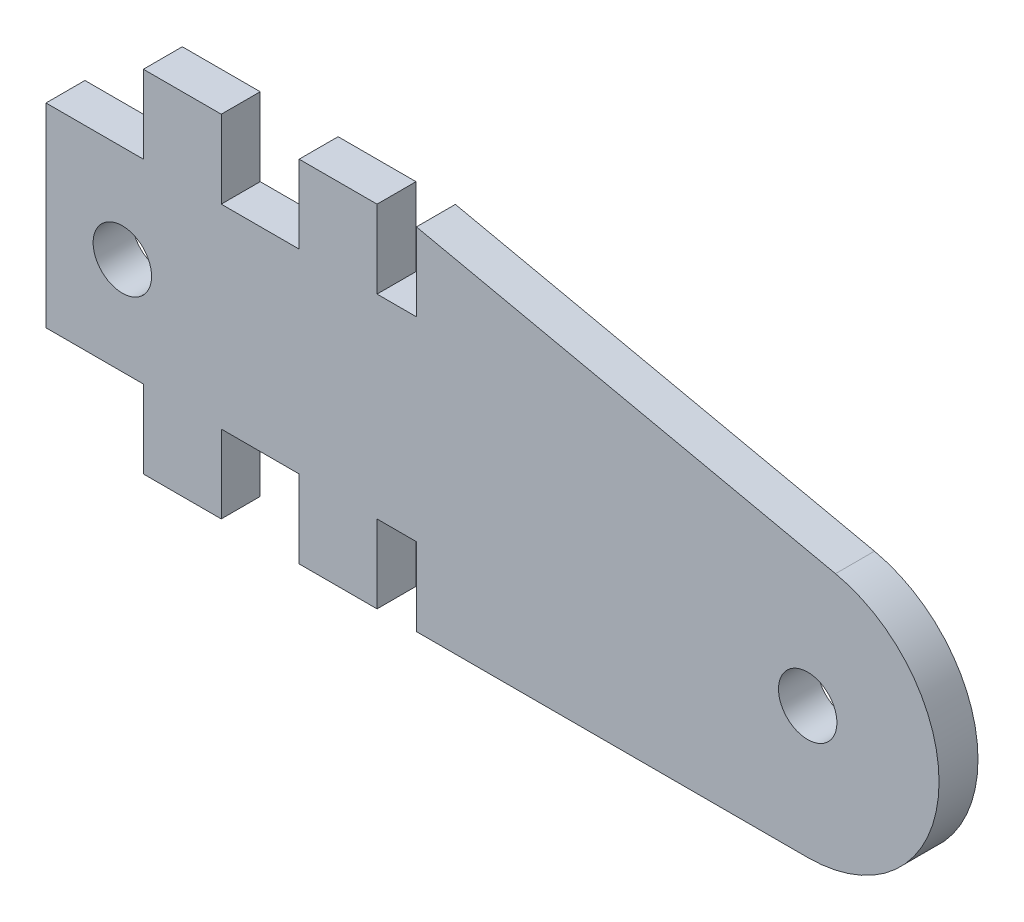
ISO-10303-21;
HEADER;
FILE_DESCRIPTION(('STEP AP214'),'2;1');
FILE_NAME('part.step','',(''),(''),'','','');
FILE_SCHEMA(('AUTOMOTIVE_DESIGN { 1 0 10303 214 1 1 1 1 }'));
ENDSEC;
DATA;
#1=APPLICATION_CONTEXT('core data for automotive mechanical design processes');
#2=APPLICATION_PROTOCOL_DEFINITION('international standard','automotive_design',2000,#1);
#3=PRODUCT_CONTEXT('',#1,'mechanical');
#4=PRODUCT('Part','Part','',(#3));
#5=PRODUCT_RELATED_PRODUCT_CATEGORY('part','',(#4));
#6=PRODUCT_DEFINITION_FORMATION('','',#4);
#7=PRODUCT_DEFINITION_CONTEXT('part definition',#1,'design');
#8=PRODUCT_DEFINITION('design','',#6,#7);
#9=PRODUCT_DEFINITION_SHAPE('','',#8);
#10=(LENGTH_UNIT() NAMED_UNIT(*) SI_UNIT(.MILLI.,.METRE.));
#11=(NAMED_UNIT(*) PLANE_ANGLE_UNIT() SI_UNIT($,.RADIAN.));
#12=(NAMED_UNIT(*) SI_UNIT($,.STERADIAN.) SOLID_ANGLE_UNIT());
#13=UNCERTAINTY_MEASURE_WITH_UNIT(LENGTH_MEASURE(1.E-05),#10,'distance_accuracy_value','');
#14=(GEOMETRIC_REPRESENTATION_CONTEXT(3) GLOBAL_UNCERTAINTY_ASSIGNED_CONTEXT((#13)) GLOBAL_UNIT_ASSIGNED_CONTEXT((#10,
#11,#12)) REPRESENTATION_CONTEXT('',''));
#15=CARTESIAN_POINT('',(0.,0.,0.));
#16=DIRECTION('',(0.,0.,1.));
#17=DIRECTION('',(1.,0.,0.));
#18=AXIS2_PLACEMENT_3D('',#15,#16,#17);
#19=CARTESIAN_POINT('',(39.11449585108,6.74534308282998,2.));
#20=DIRECTION('',(0.,0.,1.));
#21=DIRECTION('',(1.,0.,0.));
#22=AXIS2_PLACEMENT_3D('',#19,#20,#21);
#23=PLANE('',#22);
#24=CARTESIAN_POINT('',(3.92049009293526,8.99999999999998,2.));
#25=DIRECTION('',(0.,0.,1.));
#26=DIRECTION('',(1.,0.,0.));
#27=AXIS2_PLACEMENT_3D('',#24,#25,#26);
#28=CIRCLE('',#27,1.5);
#29=CARTESIAN_POINT('',(5.42049009293527,8.99999999999998,2.));
#30=VERTEX_POINT('',#29);
#31=EDGE_CURVE('E230',#30,#30,#28,.T.);
#32=ORIENTED_EDGE('',*,*,#31,.F.);
#33=EDGE_LOOP('',(#32));
#34=FACE_BOUND('',#33,.T.);
#35=DIRECTION('',(0.,1.,0.));
#36=VECTOR('',#35,1.);
#37=CARTESIAN_POINT('',(9.,0.,2.));
#38=LINE('',#37,#36);
#39=CARTESIAN_POINT('',(9.,0.,2.));
#40=VERTEX_POINT('',#39);
#41=CARTESIAN_POINT('',(9.,4.,2.));
#42=VERTEX_POINT('',#41);
#43=EDGE_CURVE('E273',#40,#42,#38,.T.);
#44=ORIENTED_EDGE('',*,*,#43,.T.);
#45=DIRECTION('',(1.,0.,0.));
#46=VECTOR('',#45,1.);
#47=CARTESIAN_POINT('',(9.,4.,2.));
#48=LINE('',#47,#46);
#49=CARTESIAN_POINT('',(13.,4.,2.));
#50=VERTEX_POINT('',#49);
#51=EDGE_CURVE('E141',#42,#50,#48,.T.);
#52=ORIENTED_EDGE('',*,*,#51,.T.);
#53=DIRECTION('',(0.,-1.,0.));
#54=VECTOR('',#53,1.);
#55=CARTESIAN_POINT('',(13.,4.,2.));
#56=LINE('',#55,#54);
#57=CARTESIAN_POINT('',(13.,0.,2.));
#58=VERTEX_POINT('',#57);
#59=EDGE_CURVE('E336',#50,#58,#56,.T.);
#60=ORIENTED_EDGE('',*,*,#59,.T.);
#61=DIRECTION('',(1.,0.,0.));
#62=VECTOR('',#61,1.);
#63=CARTESIAN_POINT('',(13.,0.,2.));
#64=LINE('',#63,#62);
#65=CARTESIAN_POINT('',(17.,0.,2.));
#66=VERTEX_POINT('',#65);
#67=EDGE_CURVE('E355',#58,#66,#64,.T.);
#68=ORIENTED_EDGE('',*,*,#67,.T.);
#69=DIRECTION('',(0.,1.,0.));
#70=VECTOR('',#69,1.);
#71=CARTESIAN_POINT('',(17.,0.,2.));
#72=LINE('',#71,#70);
#73=CARTESIAN_POINT('',(17.,4.,2.));
#74=VERTEX_POINT('',#73);
#75=EDGE_CURVE('E352',#66,#74,#72,.T.);
#76=ORIENTED_EDGE('',*,*,#75,.T.);
#77=DIRECTION('',(1.,0.,0.));
#78=VECTOR('',#77,1.);
#79=CARTESIAN_POINT('',(17.,4.,2.));
#80=LINE('',#79,#78);
#81=CARTESIAN_POINT('',(19.0215619335038,4.,2.));
#82=VERTEX_POINT('',#81);
#83=EDGE_CURVE('E354',#74,#82,#80,.T.);
#84=ORIENTED_EDGE('',*,*,#83,.T.);
#85=DIRECTION('',(0.,-1.,0.));
#86=VECTOR('',#85,1.);
#87=CARTESIAN_POINT('',(19.0215619335038,4.,2.));
#88=LINE('',#87,#86);
#89=CARTESIAN_POINT('',(19.0215619335038,0.,2.));
#90=VERTEX_POINT('',#89);
#91=EDGE_CURVE('E357',#82,#90,#88,.T.);
#92=ORIENTED_EDGE('',*,*,#91,.T.);
#93=DIRECTION('',(1.,0.,0.));
#94=VECTOR('',#93,1.);
#95=CARTESIAN_POINT('',(19.0215619335038,0.,2.));
#96=LINE('',#95,#94);
#97=CARTESIAN_POINT('',(39.11449585108,0.,2.));
#98=VERTEX_POINT('',#97);
#99=EDGE_CURVE('E363',#90,#98,#96,.T.);
#100=ORIENTED_EDGE('',*,*,#99,.T.);
#101=CARTESIAN_POINT('',(39.11449585108,6.74534308282998,2.));
#102=DIRECTION('',(0.,0.,1.));
#103=DIRECTION('',(1.,0.,0.));
#104=AXIS2_PLACEMENT_3D('',#101,#102,#103);
#105=CIRCLE('',#104,6.74534308282998);
#106=CARTESIAN_POINT('',(40.5426460894979,13.3377660214459,2.));
#107=VERTEX_POINT('',#106);
#108=EDGE_CURVE('E365',#98,#107,#105,.T.);
#109=ORIENTED_EDGE('',*,*,#108,.T.);
#110=DIRECTION('',(-0.977329523148594,0.211723884297783,0.));
#111=VECTOR('',#110,1.);
#112=CARTESIAN_POINT('',(19.0215619335039,17.9999883567818,2.));
#113=LINE('',#112,#111);
#114=CARTESIAN_POINT('',(19.0215619335039,17.9999883567818,2.));
#115=VERTEX_POINT('',#114);
#116=EDGE_CURVE('E367',#107,#115,#113,.T.);
#117=ORIENTED_EDGE('',*,*,#116,.T.);
#118=DIRECTION('',(0.,-1.,0.));
#119=VECTOR('',#118,1.);
#120=CARTESIAN_POINT('',(19.0215619335038,13.9999883567817,2.));
#121=LINE('',#120,#119);
#122=CARTESIAN_POINT('',(19.0215619335038,13.9999883567817,2.));
#123=VERTEX_POINT('',#122);
#124=EDGE_CURVE('E369',#115,#123,#121,.T.);
#125=ORIENTED_EDGE('',*,*,#124,.T.);
#126=DIRECTION('',(-1.,0.,0.));
#127=VECTOR('',#126,1.);
#128=CARTESIAN_POINT('',(17.,13.9999883567817,2.));
#129=LINE('',#128,#127);
#130=CARTESIAN_POINT('',(17.,13.9999883567817,2.));
#131=VERTEX_POINT('',#130);
#132=EDGE_CURVE('E371',#123,#131,#129,.T.);
#133=ORIENTED_EDGE('',*,*,#132,.T.);
#134=DIRECTION('',(0.,1.,0.));
#135=VECTOR('',#134,1.);
#136=CARTESIAN_POINT('',(17.,17.9999883567817,2.));
#137=LINE('',#136,#135);
#138=CARTESIAN_POINT('',(17.,17.9999883567817,2.));
#139=VERTEX_POINT('',#138);
#140=EDGE_CURVE('E373',#131,#139,#137,.T.);
#141=ORIENTED_EDGE('',*,*,#140,.T.);
#142=DIRECTION('',(-1.,0.,0.));
#143=VECTOR('',#142,1.);
#144=CARTESIAN_POINT('',(13.,17.9999883567817,2.));
#145=LINE('',#144,#143);
#146=CARTESIAN_POINT('',(13.,17.9999883567817,2.));
#147=VERTEX_POINT('',#146);
#148=EDGE_CURVE('E375',#139,#147,#145,.T.);
#149=ORIENTED_EDGE('',*,*,#148,.T.);
#150=DIRECTION('',(0.,-1.,0.));
#151=VECTOR('',#150,1.);
#152=CARTESIAN_POINT('',(13.,13.9999883567817,2.));
#153=LINE('',#152,#151);
#154=CARTESIAN_POINT('',(13.,13.9999883567817,2.));
#155=VERTEX_POINT('',#154);
#156=EDGE_CURVE('E377',#147,#155,#153,.T.);
#157=ORIENTED_EDGE('',*,*,#156,.T.);
#158=DIRECTION('',(-1.,0.,0.));
#159=VECTOR('',#158,1.);
#160=CARTESIAN_POINT('',(9.,13.9999883567817,2.));
#161=LINE('',#160,#159);
#162=CARTESIAN_POINT('',(9.,13.9999883567817,2.));
#163=VERTEX_POINT('',#162);
#164=EDGE_CURVE('E379',#155,#163,#161,.T.);
#165=ORIENTED_EDGE('',*,*,#164,.T.);
#166=DIRECTION('',(0.,1.,0.));
#167=VECTOR('',#166,1.);
#168=CARTESIAN_POINT('',(9.,17.9999883567817,2.));
#169=LINE('',#168,#167);
#170=CARTESIAN_POINT('',(9.,17.9999883567817,2.));
#171=VERTEX_POINT('',#170);
#172=EDGE_CURVE('E381',#163,#171,#169,.T.);
#173=ORIENTED_EDGE('',*,*,#172,.T.);
#174=DIRECTION('',(-1.,0.,0.));
#175=VECTOR('',#174,1.);
#176=CARTESIAN_POINT('',(5.,17.9999883567817,2.));
#177=LINE('',#176,#175);
#178=CARTESIAN_POINT('',(5.,17.9999883567817,2.));
#179=VERTEX_POINT('',#178);
#180=EDGE_CURVE('E383',#171,#179,#177,.T.);
#181=ORIENTED_EDGE('',*,*,#180,.T.);
#182=DIRECTION('',(0.,-1.,0.));
#183=VECTOR('',#182,1.);
#184=CARTESIAN_POINT('',(5.,13.9999883567817,2.));
#185=LINE('',#184,#183);
#186=CARTESIAN_POINT('',(5.,13.9999883567817,2.));
#187=VERTEX_POINT('',#186);
#188=EDGE_CURVE('E385',#179,#187,#185,.T.);
#189=ORIENTED_EDGE('',*,*,#188,.T.);
#190=DIRECTION('',(-1.,0.,0.));
#191=VECTOR('',#190,1.);
#192=CARTESIAN_POINT('',(5.,13.9999883567817,2.));
#193=LINE('',#192,#191);
#194=CARTESIAN_POINT('',(0.,13.9999883567817,2.));
#195=VERTEX_POINT('',#194);
#196=EDGE_CURVE('E387',#187,#195,#193,.T.);
#197=ORIENTED_EDGE('',*,*,#196,.T.);
#198=DIRECTION('',(0.,-1.,0.));
#199=VECTOR('',#198,1.);
#200=CARTESIAN_POINT('',(0.,13.9999883567817,2.));
#201=LINE('',#200,#199);
#202=CARTESIAN_POINT('',(0.,4.,2.));
#203=VERTEX_POINT('',#202);
#204=EDGE_CURVE('E208',#195,#203,#201,.T.);
#205=ORIENTED_EDGE('',*,*,#204,.T.);
#206=DIRECTION('',(1.,0.,0.));
#207=VECTOR('',#206,1.);
#208=CARTESIAN_POINT('',(0.,4.,2.));
#209=LINE('',#208,#207);
#210=CARTESIAN_POINT('',(5.,4.,2.));
#211=VERTEX_POINT('',#210);
#212=EDGE_CURVE('E202',#203,#211,#209,.T.);
#213=ORIENTED_EDGE('',*,*,#212,.T.);
#214=DIRECTION('',(0.,-1.,0.));
#215=VECTOR('',#214,1.);
#216=CARTESIAN_POINT('',(5.,4.,2.));
#217=LINE('',#216,#215);
#218=CARTESIAN_POINT('',(5.,0.,2.));
#219=VERTEX_POINT('',#218);
#220=EDGE_CURVE('E206',#211,#219,#217,.T.);
#221=ORIENTED_EDGE('',*,*,#220,.T.);
#222=DIRECTION('',(1.,0.,0.));
#223=VECTOR('',#222,1.);
#224=CARTESIAN_POINT('',(5.,0.,2.));
#225=LINE('',#224,#223);
#226=EDGE_CURVE('E50',#219,#40,#225,.T.);
#227=ORIENTED_EDGE('',*,*,#226,.T.);
#228=EDGE_LOOP('',(#44,#52,#60,#68,#76,#84,#92,#100,#109,#117,#125,#133,#141,#149,#157,#165,
#173,#181,#189,#197,#205,#213,#221,#227));
#229=FACE_BOUND('',#228,.T.);
#230=CARTESIAN_POINT('',(39.11449585108,6.74534308282998,2.));
#231=DIRECTION('',(0.,0.,1.));
#232=DIRECTION('',(1.,0.,0.));
#233=AXIS2_PLACEMENT_3D('',#230,#231,#232);
#234=CIRCLE('',#233,1.5);
#235=CARTESIAN_POINT('',(40.61449585108,6.74534308282998,2.));
#236=VERTEX_POINT('',#235);
#237=EDGE_CURVE('E430',#236,#236,#234,.T.);
#238=ORIENTED_EDGE('',*,*,#237,.F.);
#239=EDGE_LOOP('',(#238));
#240=FACE_BOUND('',#239,.T.);
#241=ADVANCED_FACE('F33',(#34,#229,#240),#23,.T.);
#242=CARTESIAN_POINT('',(39.11449585108,6.74534308282998,0.));
#243=DIRECTION('',(0.,0.,1.));
#244=DIRECTION('',(1.,0.,0.));
#245=AXIS2_PLACEMENT_3D('',#242,#243,#244);
#246=PLANE('',#245);
#247=CARTESIAN_POINT('',(3.92049009293526,8.99999999999998,0.));
#248=DIRECTION('',(0.,0.,1.));
#249=DIRECTION('',(1.,0.,0.));
#250=AXIS2_PLACEMENT_3D('',#247,#248,#249);
#251=CIRCLE('',#250,1.5);
#252=CARTESIAN_POINT('',(5.42049009293527,8.99999999999998,0.));
#253=VERTEX_POINT('',#252);
#254=EDGE_CURVE('E435',#253,#253,#251,.T.);
#255=ORIENTED_EDGE('',*,*,#254,.T.);
#256=EDGE_LOOP('',(#255));
#257=FACE_BOUND('',#256,.T.);
#258=DIRECTION('',(0.,1.,0.));
#259=VECTOR('',#258,1.);
#260=CARTESIAN_POINT('',(9.,0.,0.));
#261=LINE('',#260,#259);
#262=CARTESIAN_POINT('',(9.,0.,0.));
#263=VERTEX_POINT('',#262);
#264=CARTESIAN_POINT('',(9.,4.,0.));
#265=VERTEX_POINT('',#264);
#266=EDGE_CURVE('E226',#263,#265,#261,.T.);
#267=ORIENTED_EDGE('',*,*,#266,.F.);
#268=DIRECTION('',(1.,0.,0.));
#269=VECTOR('',#268,1.);
#270=CARTESIAN_POINT('',(5.,0.,0.));
#271=LINE('',#270,#269);
#272=CARTESIAN_POINT('',(5.,0.,0.));
#273=VERTEX_POINT('',#272);
#274=EDGE_CURVE('E133',#273,#263,#271,.T.);
#275=ORIENTED_EDGE('',*,*,#274,.F.);
#276=DIRECTION('',(0.,-1.,0.));
#277=VECTOR('',#276,1.);
#278=CARTESIAN_POINT('',(5.,4.,0.));
#279=LINE('',#278,#277);
#280=CARTESIAN_POINT('',(5.,4.,0.));
#281=VERTEX_POINT('',#280);
#282=EDGE_CURVE('E127',#281,#273,#279,.T.);
#283=ORIENTED_EDGE('',*,*,#282,.F.);
#284=DIRECTION('',(1.,0.,0.));
#285=VECTOR('',#284,1.);
#286=CARTESIAN_POINT('',(0.,4.,0.));
#287=LINE('',#286,#285);
#288=CARTESIAN_POINT('',(0.,4.,0.));
#289=VERTEX_POINT('',#288);
#290=EDGE_CURVE('E216',#289,#281,#287,.T.);
#291=ORIENTED_EDGE('',*,*,#290,.F.);
#292=DIRECTION('',(0.,-1.,0.));
#293=VECTOR('',#292,1.);
#294=CARTESIAN_POINT('',(0.,13.9999883567817,0.));
#295=LINE('',#294,#293);
#296=CARTESIAN_POINT('',(0.,13.9999883567817,0.));
#297=VERTEX_POINT('',#296);
#298=EDGE_CURVE('E268',#297,#289,#295,.T.);
#299=ORIENTED_EDGE('',*,*,#298,.F.);
#300=DIRECTION('',(-1.,0.,0.));
#301=VECTOR('',#300,1.);
#302=CARTESIAN_POINT('',(5.,13.9999883567817,0.));
#303=LINE('',#302,#301);
#304=CARTESIAN_POINT('',(5.,13.9999883567817,0.));
#305=VERTEX_POINT('',#304);
#306=EDGE_CURVE('E266',#305,#297,#303,.T.);
#307=ORIENTED_EDGE('',*,*,#306,.F.);
#308=DIRECTION('',(0.,-1.,0.));
#309=VECTOR('',#308,1.);
#310=CARTESIAN_POINT('',(5.,13.9999883567817,0.));
#311=LINE('',#310,#309);
#312=CARTESIAN_POINT('',(5.,17.9999883567817,0.));
#313=VERTEX_POINT('',#312);
#314=EDGE_CURVE('E264',#313,#305,#311,.T.);
#315=ORIENTED_EDGE('',*,*,#314,.F.);
#316=DIRECTION('',(-1.,0.,0.));
#317=VECTOR('',#316,1.);
#318=CARTESIAN_POINT('',(5.,17.9999883567817,0.));
#319=LINE('',#318,#317);
#320=CARTESIAN_POINT('',(9.,17.9999883567817,0.));
#321=VERTEX_POINT('',#320);
#322=EDGE_CURVE('E262',#321,#313,#319,.T.);
#323=ORIENTED_EDGE('',*,*,#322,.F.);
#324=DIRECTION('',(0.,1.,0.));
#325=VECTOR('',#324,1.);
#326=CARTESIAN_POINT('',(9.,17.9999883567817,0.));
#327=LINE('',#326,#325);
#328=CARTESIAN_POINT('',(9.,13.9999883567817,0.));
#329=VERTEX_POINT('',#328);
#330=EDGE_CURVE('E260',#329,#321,#327,.T.);
#331=ORIENTED_EDGE('',*,*,#330,.F.);
#332=DIRECTION('',(-1.,0.,0.));
#333=VECTOR('',#332,1.);
#334=CARTESIAN_POINT('',(9.,13.9999883567817,0.));
#335=LINE('',#334,#333);
#336=CARTESIAN_POINT('',(13.,13.9999883567817,0.));
#337=VERTEX_POINT('',#336);
#338=EDGE_CURVE('E258',#337,#329,#335,.T.);
#339=ORIENTED_EDGE('',*,*,#338,.F.);
#340=DIRECTION('',(0.,-1.,0.));
#341=VECTOR('',#340,1.);
#342=CARTESIAN_POINT('',(13.,13.9999883567817,0.));
#343=LINE('',#342,#341);
#344=CARTESIAN_POINT('',(13.,17.9999883567817,0.));
#345=VERTEX_POINT('',#344);
#346=EDGE_CURVE('E256',#345,#337,#343,.T.);
#347=ORIENTED_EDGE('',*,*,#346,.F.);
#348=DIRECTION('',(-1.,0.,0.));
#349=VECTOR('',#348,1.);
#350=CARTESIAN_POINT('',(13.,17.9999883567817,0.));
#351=LINE('',#350,#349);
#352=CARTESIAN_POINT('',(17.,17.9999883567817,0.));
#353=VERTEX_POINT('',#352);
#354=EDGE_CURVE('E254',#353,#345,#351,.T.);
#355=ORIENTED_EDGE('',*,*,#354,.F.);
#356=DIRECTION('',(0.,1.,0.));
#357=VECTOR('',#356,1.);
#358=CARTESIAN_POINT('',(17.,17.9999883567817,0.));
#359=LINE('',#358,#357);
#360=CARTESIAN_POINT('',(17.,13.9999883567817,0.));
#361=VERTEX_POINT('',#360);
#362=EDGE_CURVE('E252',#361,#353,#359,.T.);
#363=ORIENTED_EDGE('',*,*,#362,.F.);
#364=DIRECTION('',(-1.,0.,0.));
#365=VECTOR('',#364,1.);
#366=CARTESIAN_POINT('',(17.,13.9999883567817,0.));
#367=LINE('',#366,#365);
#368=CARTESIAN_POINT('',(19.0215619335038,13.9999883567817,0.));
#369=VERTEX_POINT('',#368);
#370=EDGE_CURVE('E250',#369,#361,#367,.T.);
#371=ORIENTED_EDGE('',*,*,#370,.F.);
#372=DIRECTION('',(0.,-1.,0.));
#373=VECTOR('',#372,1.);
#374=CARTESIAN_POINT('',(19.0215619335038,13.9999883567817,0.));
#375=LINE('',#374,#373);
#376=CARTESIAN_POINT('',(19.0215619335039,17.9999883567818,0.));
#377=VERTEX_POINT('',#376);
#378=EDGE_CURVE('E248',#377,#369,#375,.T.);
#379=ORIENTED_EDGE('',*,*,#378,.F.);
#380=DIRECTION('',(-0.977329523148594,0.211723884297783,0.));
#381=VECTOR('',#380,1.);
#382=CARTESIAN_POINT('',(19.0215619335039,17.9999883567818,0.));
#383=LINE('',#382,#381);
#384=CARTESIAN_POINT('',(40.5426460894979,13.3377660214459,0.));
#385=VERTEX_POINT('',#384);
#386=EDGE_CURVE('E246',#385,#377,#383,.T.);
#387=ORIENTED_EDGE('',*,*,#386,.F.);
#388=CARTESIAN_POINT('',(39.11449585108,6.74534308282998,0.));
#389=DIRECTION('',(0.,0.,1.));
#390=DIRECTION('',(1.,0.,0.));
#391=AXIS2_PLACEMENT_3D('',#388,#389,#390);
#392=CIRCLE('',#391,6.74534308282998);
#393=CARTESIAN_POINT('',(39.11449585108,0.,0.));
#394=VERTEX_POINT('',#393);
#395=EDGE_CURVE('E244',#394,#385,#392,.T.);
#396=ORIENTED_EDGE('',*,*,#395,.F.);
#397=DIRECTION('',(1.,0.,0.));
#398=VECTOR('',#397,1.);
#399=CARTESIAN_POINT('',(19.0215619335038,0.,0.));
#400=LINE('',#399,#398);
#401=CARTESIAN_POINT('',(19.0215619335038,0.,0.));
#402=VERTEX_POINT('',#401);
#403=EDGE_CURVE('E242',#402,#394,#400,.T.);
#404=ORIENTED_EDGE('',*,*,#403,.F.);
#405=DIRECTION('',(0.,-1.,0.));
#406=VECTOR('',#405,1.);
#407=CARTESIAN_POINT('',(19.0215619335038,4.,0.));
#408=LINE('',#407,#406);
#409=CARTESIAN_POINT('',(19.0215619335038,4.,0.));
#410=VERTEX_POINT('',#409);
#411=EDGE_CURVE('E240',#410,#402,#408,.T.);
#412=ORIENTED_EDGE('',*,*,#411,.F.);
#413=DIRECTION('',(1.,0.,0.));
#414=VECTOR('',#413,1.);
#415=CARTESIAN_POINT('',(17.,4.,0.));
#416=LINE('',#415,#414);
#417=CARTESIAN_POINT('',(17.,4.,0.));
#418=VERTEX_POINT('',#417);
#419=EDGE_CURVE('E238',#418,#410,#416,.T.);
#420=ORIENTED_EDGE('',*,*,#419,.F.);
#421=DIRECTION('',(0.,1.,0.));
#422=VECTOR('',#421,1.);
#423=CARTESIAN_POINT('',(17.,0.,0.));
#424=LINE('',#423,#422);
#425=CARTESIAN_POINT('',(17.,0.,0.));
#426=VERTEX_POINT('',#425);
#427=EDGE_CURVE('E236',#426,#418,#424,.T.);
#428=ORIENTED_EDGE('',*,*,#427,.F.);
#429=DIRECTION('',(1.,0.,0.));
#430=VECTOR('',#429,1.);
#431=CARTESIAN_POINT('',(13.,0.,0.));
#432=LINE('',#431,#430);
#433=CARTESIAN_POINT('',(13.,0.,0.));
#434=VERTEX_POINT('',#433);
#435=EDGE_CURVE('E234',#434,#426,#432,.T.);
#436=ORIENTED_EDGE('',*,*,#435,.F.);
#437=DIRECTION('',(0.,-1.,0.));
#438=VECTOR('',#437,1.);
#439=CARTESIAN_POINT('',(13.,4.,0.));
#440=LINE('',#439,#438);
#441=CARTESIAN_POINT('',(13.,4.,0.));
#442=VERTEX_POINT('',#441);
#443=EDGE_CURVE('E232',#442,#434,#440,.T.);
#444=ORIENTED_EDGE('',*,*,#443,.F.);
#445=DIRECTION('',(1.,0.,0.));
#446=VECTOR('',#445,1.);
#447=CARTESIAN_POINT('',(9.,4.,0.));
#448=LINE('',#447,#446);
#449=EDGE_CURVE('E229',#265,#442,#448,.T.);
#450=ORIENTED_EDGE('',*,*,#449,.F.);
#451=EDGE_LOOP('',(#267,#275,#283,#291,#299,#307,#315,#323,#331,#339,#347,#355,#363,#371,#379,
#387,#396,#404,#412,#420,#428,#436,#444,#450));
#452=FACE_BOUND('',#451,.T.);
#453=CARTESIAN_POINT('',(39.11449585108,6.74534308282998,0.));
#454=DIRECTION('',(0.,0.,1.));
#455=DIRECTION('',(1.,0.,0.));
#456=AXIS2_PLACEMENT_3D('',#453,#454,#455);
#457=CIRCLE('',#456,1.5);
#458=CARTESIAN_POINT('',(40.61449585108,6.74534308282998,0.));
#459=VERTEX_POINT('',#458);
#460=EDGE_CURVE('E433',#459,#459,#457,.T.);
#461=ORIENTED_EDGE('',*,*,#460,.T.);
#462=EDGE_LOOP('',(#461));
#463=FACE_BOUND('',#462,.T.);
#464=ADVANCED_FACE('F340',(#257,#452,#463),#246,.F.);
#465=CARTESIAN_POINT('',(9.,0.,2.));
#466=DIRECTION('',(-1.,0.,0.));
#467=DIRECTION('',(0.,0.,1.));
#468=AXIS2_PLACEMENT_3D('',#465,#466,#467);
#469=PLANE('',#468);
#470=ORIENTED_EDGE('',*,*,#266,.T.);
#471=DIRECTION('',(0.,0.,-1.));
#472=VECTOR('',#471,1.);
#473=CARTESIAN_POINT('',(9.,4.,2.));
#474=LINE('',#473,#472);
#475=EDGE_CURVE('E11',#42,#265,#474,.T.);
#476=ORIENTED_EDGE('',*,*,#475,.F.);
#477=ORIENTED_EDGE('',*,*,#43,.F.);
#478=DIRECTION('',(0.,0.,-1.));
#479=VECTOR('',#478,1.);
#480=CARTESIAN_POINT('',(9.,0.,2.));
#481=LINE('',#480,#479);
#482=EDGE_CURVE('E222',#40,#263,#481,.T.);
#483=ORIENTED_EDGE('',*,*,#482,.T.);
#484=EDGE_LOOP('',(#470,#476,#477,#483));
#485=FACE_BOUND('',#484,.T.);
#486=ADVANCED_FACE('F35',(#485),#469,.F.);
#487=CARTESIAN_POINT('',(9.,4.,2.));
#488=DIRECTION('',(0.,1.,0.));
#489=DIRECTION('',(0.,0.,1.));
#490=AXIS2_PLACEMENT_3D('',#487,#488,#489);
#491=PLANE('',#490);
#492=ORIENTED_EDGE('',*,*,#449,.T.);
#493=DIRECTION('',(0.,0.,-1.));
#494=VECTOR('',#493,1.);
#495=CARTESIAN_POINT('',(13.,4.,2.));
#496=LINE('',#495,#494);
#497=EDGE_CURVE('E42',#50,#442,#496,.T.);
#498=ORIENTED_EDGE('',*,*,#497,.F.);
#499=ORIENTED_EDGE('',*,*,#51,.F.);
#500=ORIENTED_EDGE('',*,*,#475,.T.);
#501=EDGE_LOOP('',(#492,#498,#499,#500));
#502=FACE_BOUND('',#501,.T.);
#503=ADVANCED_FACE('F648',(#502),#491,.F.);
#504=CARTESIAN_POINT('',(13.,4.,2.));
#505=DIRECTION('',(1.,0.,0.));
#506=DIRECTION('',(0.,1.,0.));
#507=AXIS2_PLACEMENT_3D('',#504,#505,#506);
#508=PLANE('',#507);
#509=ORIENTED_EDGE('',*,*,#443,.T.);
#510=DIRECTION('',(0.,0.,-1.));
#511=VECTOR('',#510,1.);
#512=CARTESIAN_POINT('',(13.,0.,2.));
#513=LINE('',#512,#511);
#514=EDGE_CURVE('E328',#58,#434,#513,.T.);
#515=ORIENTED_EDGE('',*,*,#514,.F.);
#516=ORIENTED_EDGE('',*,*,#59,.F.);
#517=ORIENTED_EDGE('',*,*,#497,.T.);
#518=EDGE_LOOP('',(#509,#515,#516,#517));
#519=FACE_BOUND('',#518,.T.);
#520=ADVANCED_FACE('F334',(#519),#508,.F.);
#521=CARTESIAN_POINT('',(13.,0.,2.));
#522=DIRECTION('',(0.,1.,0.));
#523=DIRECTION('',(-1.,0.,0.));
#524=AXIS2_PLACEMENT_3D('',#521,#522,#523);
#525=PLANE('',#524);
#526=ORIENTED_EDGE('',*,*,#435,.T.);
#527=DIRECTION('',(0.,0.,-1.));
#528=VECTOR('',#527,1.);
#529=CARTESIAN_POINT('',(17.,0.,2.));
#530=LINE('',#529,#528);
#531=EDGE_CURVE('E325',#66,#426,#530,.T.);
#532=ORIENTED_EDGE('',*,*,#531,.F.);
#533=ORIENTED_EDGE('',*,*,#67,.F.);
#534=ORIENTED_EDGE('',*,*,#514,.T.);
#535=EDGE_LOOP('',(#526,#532,#533,#534));
#536=FACE_BOUND('',#535,.T.);
#537=ADVANCED_FACE('F346',(#536),#525,.F.);
#538=CARTESIAN_POINT('',(17.,0.,2.));
#539=DIRECTION('',(-1.,0.,0.));
#540=DIRECTION('',(0.,0.,1.));
#541=AXIS2_PLACEMENT_3D('',#538,#539,#540);
#542=PLANE('',#541);
#543=ORIENTED_EDGE('',*,*,#427,.T.);
#544=DIRECTION('',(0.,0.,-1.));
#545=VECTOR('',#544,1.);
#546=CARTESIAN_POINT('',(17.,4.,2.));
#547=LINE('',#546,#545);
#548=EDGE_CURVE('E322',#74,#418,#547,.T.);
#549=ORIENTED_EDGE('',*,*,#548,.F.);
#550=ORIENTED_EDGE('',*,*,#75,.F.);
#551=ORIENTED_EDGE('',*,*,#531,.T.);
#552=EDGE_LOOP('',(#543,#549,#550,#551));
#553=FACE_BOUND('',#552,.T.);
#554=ADVANCED_FACE('F350',(#553),#542,.F.);
#555=CARTESIAN_POINT('',(17.,4.,2.));
#556=DIRECTION('',(0.,1.,0.));
#557=DIRECTION('',(0.,0.,1.));
#558=AXIS2_PLACEMENT_3D('',#555,#556,#557);
#559=PLANE('',#558);
#560=ORIENTED_EDGE('',*,*,#419,.T.);
#561=DIRECTION('',(0.,0.,-1.));
#562=VECTOR('',#561,1.);
#563=CARTESIAN_POINT('',(19.0215619335038,4.,2.));
#564=LINE('',#563,#562);
#565=EDGE_CURVE('E319',#82,#410,#564,.T.);
#566=ORIENTED_EDGE('',*,*,#565,.F.);
#567=ORIENTED_EDGE('',*,*,#83,.F.);
#568=ORIENTED_EDGE('',*,*,#548,.T.);
#569=EDGE_LOOP('',(#560,#566,#567,#568));
#570=FACE_BOUND('',#569,.T.);
#571=ADVANCED_FACE('F613',(#570),#559,.F.);
#572=CARTESIAN_POINT('',(19.0215619335038,4.,2.));
#573=DIRECTION('',(1.,0.,0.));
#574=DIRECTION('',(0.,0.,-1.));
#575=AXIS2_PLACEMENT_3D('',#572,#573,#574);
#576=PLANE('',#575);
#577=ORIENTED_EDGE('',*,*,#411,.T.);
#578=DIRECTION('',(0.,0.,-1.));
#579=VECTOR('',#578,1.);
#580=CARTESIAN_POINT('',(19.0215619335038,0.,2.));
#581=LINE('',#580,#579);
#582=EDGE_CURVE('E316',#90,#402,#581,.T.);
#583=ORIENTED_EDGE('',*,*,#582,.F.);
#584=ORIENTED_EDGE('',*,*,#91,.F.);
#585=ORIENTED_EDGE('',*,*,#565,.T.);
#586=EDGE_LOOP('',(#577,#583,#584,#585));
#587=FACE_BOUND('',#586,.T.);
#588=ADVANCED_FACE('F603',(#587),#576,.F.);
#589=CARTESIAN_POINT('',(19.0215619335038,0.,2.));
#590=DIRECTION('',(0.,1.,0.));
#591=DIRECTION('',(0.,0.,1.));
#592=AXIS2_PLACEMENT_3D('',#589,#590,#591);
#593=PLANE('',#592);
#594=ORIENTED_EDGE('',*,*,#403,.T.);
#595=DIRECTION('',(0.,0.,-1.));
#596=VECTOR('',#595,1.);
#597=CARTESIAN_POINT('',(39.11449585108,0.,2.));
#598=LINE('',#597,#596);
#599=EDGE_CURVE('E313',#98,#394,#598,.T.);
#600=ORIENTED_EDGE('',*,*,#599,.F.);
#601=ORIENTED_EDGE('',*,*,#99,.F.);
#602=ORIENTED_EDGE('',*,*,#582,.T.);
#603=EDGE_LOOP('',(#594,#600,#601,#602));
#604=FACE_BOUND('',#603,.T.);
#605=ADVANCED_FACE('F593',(#604),#593,.F.);
#606=CARTESIAN_POINT('',(39.11449585108,6.74534308282998,2.));
#607=DIRECTION('',(0.,0.,-1.));
#608=DIRECTION('',(-1.,0.,0.));
#609=AXIS2_PLACEMENT_3D('',#606,#607,#608);
#610=CYLINDRICAL_SURFACE('',#609,6.74534308282998);
#611=ORIENTED_EDGE('',*,*,#395,.T.);
#612=DIRECTION('',(0.,0.,-1.));
#613=VECTOR('',#612,1.);
#614=CARTESIAN_POINT('',(40.5426460894979,13.3377660214459,2.));
#615=LINE('',#614,#613);
#616=EDGE_CURVE('E310',#107,#385,#615,.T.);
#617=ORIENTED_EDGE('',*,*,#616,.F.);
#618=ORIENTED_EDGE('',*,*,#108,.F.);
#619=ORIENTED_EDGE('',*,*,#599,.T.);
#620=EDGE_LOOP('',(#611,#617,#618,#619));
#621=FACE_BOUND('',#620,.T.);
#622=ADVANCED_FACE('F583',(#621),#610,.T.);
#623=CARTESIAN_POINT('',(19.0215619335039,17.9999883567818,2.));
#624=DIRECTION('',(-0.211723884297783,-0.977329523148594,0.));
#625=DIRECTION('',(0.977329523148594,-0.211723884297783,0.));
#626=AXIS2_PLACEMENT_3D('',#623,#624,#625);
#627=PLANE('',#626);
#628=ORIENTED_EDGE('',*,*,#386,.T.);
#629=DIRECTION('',(0.,0.,-1.));
#630=VECTOR('',#629,1.);
#631=CARTESIAN_POINT('',(19.0215619335039,17.9999883567818,2.));
#632=LINE('',#631,#630);
#633=EDGE_CURVE('E307',#115,#377,#632,.T.);
#634=ORIENTED_EDGE('',*,*,#633,.F.);
#635=ORIENTED_EDGE('',*,*,#116,.F.);
#636=ORIENTED_EDGE('',*,*,#616,.T.);
#637=EDGE_LOOP('',(#628,#634,#635,#636));
#638=FACE_BOUND('',#637,.T.);
#639=ADVANCED_FACE('F573',(#638),#627,.F.);
#640=CARTESIAN_POINT('',(19.0215619335038,13.9999883567817,2.));
#641=DIRECTION('',(1.,0.,0.));
#642=DIRECTION('',(0.,1.,0.));
#643=AXIS2_PLACEMENT_3D('',#640,#641,#642);
#644=PLANE('',#643);
#645=ORIENTED_EDGE('',*,*,#378,.T.);
#646=DIRECTION('',(0.,0.,-1.));
#647=VECTOR('',#646,1.);
#648=CARTESIAN_POINT('',(19.0215619335038,13.9999883567817,2.));
#649=LINE('',#648,#647);
#650=EDGE_CURVE('E304',#123,#369,#649,.T.);
#651=ORIENTED_EDGE('',*,*,#650,.F.);
#652=ORIENTED_EDGE('',*,*,#124,.F.);
#653=ORIENTED_EDGE('',*,*,#633,.T.);
#654=EDGE_LOOP('',(#645,#651,#652,#653));
#655=FACE_BOUND('',#654,.T.);
#656=ADVANCED_FACE('F563',(#655),#644,.F.);
#657=CARTESIAN_POINT('',(17.,13.9999883567817,2.));
#658=DIRECTION('',(0.,-1.,0.));
#659=DIRECTION('',(0.,0.,-1.));
#660=AXIS2_PLACEMENT_3D('',#657,#658,#659);
#661=PLANE('',#660);
#662=ORIENTED_EDGE('',*,*,#370,.T.);
#663=DIRECTION('',(0.,0.,-1.));
#664=VECTOR('',#663,1.);
#665=CARTESIAN_POINT('',(17.,13.9999883567817,2.));
#666=LINE('',#665,#664);
#667=EDGE_CURVE('E301',#131,#361,#666,.T.);
#668=ORIENTED_EDGE('',*,*,#667,.F.);
#669=ORIENTED_EDGE('',*,*,#132,.F.);
#670=ORIENTED_EDGE('',*,*,#650,.T.);
#671=EDGE_LOOP('',(#662,#668,#669,#670));
#672=FACE_BOUND('',#671,.T.);
#673=ADVANCED_FACE('F553',(#672),#661,.F.);
#674=CARTESIAN_POINT('',(17.,17.9999883567817,2.));
#675=DIRECTION('',(-1.,0.,0.));
#676=DIRECTION('',(0.,-1.,0.));
#677=AXIS2_PLACEMENT_3D('',#674,#675,#676);
#678=PLANE('',#677);
#679=ORIENTED_EDGE('',*,*,#362,.T.);
#680=DIRECTION('',(0.,0.,-1.));
#681=VECTOR('',#680,1.);
#682=CARTESIAN_POINT('',(17.,17.9999883567817,2.));
#683=LINE('',#682,#681);
#684=EDGE_CURVE('E298',#139,#353,#683,.T.);
#685=ORIENTED_EDGE('',*,*,#684,.F.);
#686=ORIENTED_EDGE('',*,*,#140,.F.);
#687=ORIENTED_EDGE('',*,*,#667,.T.);
#688=EDGE_LOOP('',(#679,#685,#686,#687));
#689=FACE_BOUND('',#688,.T.);
#690=ADVANCED_FACE('F543',(#689),#678,.F.);
#691=CARTESIAN_POINT('',(13.,17.9999883567817,2.));
#692=DIRECTION('',(0.,-1.,0.));
#693=DIRECTION('',(0.,0.,-1.));
#694=AXIS2_PLACEMENT_3D('',#691,#692,#693);
#695=PLANE('',#694);
#696=ORIENTED_EDGE('',*,*,#354,.T.);
#697=DIRECTION('',(0.,0.,-1.));
#698=VECTOR('',#697,1.);
#699=CARTESIAN_POINT('',(13.,17.9999883567817,2.));
#700=LINE('',#699,#698);
#701=EDGE_CURVE('E295',#147,#345,#700,.T.);
#702=ORIENTED_EDGE('',*,*,#701,.F.);
#703=ORIENTED_EDGE('',*,*,#148,.F.);
#704=ORIENTED_EDGE('',*,*,#684,.T.);
#705=EDGE_LOOP('',(#696,#702,#703,#704));
#706=FACE_BOUND('',#705,.T.);
#707=ADVANCED_FACE('F533',(#706),#695,.F.);
#708=CARTESIAN_POINT('',(13.,13.9999883567817,2.));
#709=DIRECTION('',(1.,0.,0.));
#710=DIRECTION('',(0.,0.,-1.));
#711=AXIS2_PLACEMENT_3D('',#708,#709,#710);
#712=PLANE('',#711);
#713=ORIENTED_EDGE('',*,*,#346,.T.);
#714=DIRECTION('',(0.,0.,-1.));
#715=VECTOR('',#714,1.);
#716=CARTESIAN_POINT('',(13.,13.9999883567817,2.));
#717=LINE('',#716,#715);
#718=EDGE_CURVE('E292',#155,#337,#717,.T.);
#719=ORIENTED_EDGE('',*,*,#718,.F.);
#720=ORIENTED_EDGE('',*,*,#156,.F.);
#721=ORIENTED_EDGE('',*,*,#701,.T.);
#722=EDGE_LOOP('',(#713,#719,#720,#721));
#723=FACE_BOUND('',#722,.T.);
#724=ADVANCED_FACE('F523',(#723),#712,.F.);
#725=CARTESIAN_POINT('',(9.,13.9999883567817,2.));
#726=DIRECTION('',(0.,-1.,0.));
#727=DIRECTION('',(0.,0.,-1.));
#728=AXIS2_PLACEMENT_3D('',#725,#726,#727);
#729=PLANE('',#728);
#730=ORIENTED_EDGE('',*,*,#338,.T.);
#731=DIRECTION('',(0.,0.,-1.));
#732=VECTOR('',#731,1.);
#733=CARTESIAN_POINT('',(9.,13.9999883567817,2.));
#734=LINE('',#733,#732);
#735=EDGE_CURVE('E289',#163,#329,#734,.T.);
#736=ORIENTED_EDGE('',*,*,#735,.F.);
#737=ORIENTED_EDGE('',*,*,#164,.F.);
#738=ORIENTED_EDGE('',*,*,#718,.T.);
#739=EDGE_LOOP('',(#730,#736,#737,#738));
#740=FACE_BOUND('',#739,.T.);
#741=ADVANCED_FACE('F513',(#740),#729,.F.);
#742=CARTESIAN_POINT('',(9.,17.9999883567817,2.));
#743=DIRECTION('',(-1.,0.,0.));
#744=DIRECTION('',(0.,0.,1.));
#745=AXIS2_PLACEMENT_3D('',#742,#743,#744);
#746=PLANE('',#745);
#747=ORIENTED_EDGE('',*,*,#330,.T.);
#748=DIRECTION('',(0.,0.,-1.));
#749=VECTOR('',#748,1.);
#750=CARTESIAN_POINT('',(9.,17.9999883567817,2.));
#751=LINE('',#750,#749);
#752=EDGE_CURVE('E286',#171,#321,#751,.T.);
#753=ORIENTED_EDGE('',*,*,#752,.F.);
#754=ORIENTED_EDGE('',*,*,#172,.F.);
#755=ORIENTED_EDGE('',*,*,#735,.T.);
#756=EDGE_LOOP('',(#747,#753,#754,#755));
#757=FACE_BOUND('',#756,.T.);
#758=ADVANCED_FACE('F503',(#757),#746,.F.);
#759=CARTESIAN_POINT('',(5.,17.9999883567817,2.));
#760=DIRECTION('',(0.,-1.,0.));
#761=DIRECTION('',(0.,0.,-1.));
#762=AXIS2_PLACEMENT_3D('',#759,#760,#761);
#763=PLANE('',#762);
#764=ORIENTED_EDGE('',*,*,#322,.T.);
#765=DIRECTION('',(0.,0.,-1.));
#766=VECTOR('',#765,1.);
#767=CARTESIAN_POINT('',(5.,17.9999883567817,2.));
#768=LINE('',#767,#766);
#769=EDGE_CURVE('E283',#179,#313,#768,.T.);
#770=ORIENTED_EDGE('',*,*,#769,.F.);
#771=ORIENTED_EDGE('',*,*,#180,.F.);
#772=ORIENTED_EDGE('',*,*,#752,.T.);
#773=EDGE_LOOP('',(#764,#770,#771,#772));
#774=FACE_BOUND('',#773,.T.);
#775=ADVANCED_FACE('F493',(#774),#763,.F.);
#776=CARTESIAN_POINT('',(5.,13.9999883567817,2.));
#777=DIRECTION('',(1.,0.,0.));
#778=DIRECTION('',(0.,0.,-1.));
#779=AXIS2_PLACEMENT_3D('',#776,#777,#778);
#780=PLANE('',#779);
#781=ORIENTED_EDGE('',*,*,#314,.T.);
#782=DIRECTION('',(0.,0.,-1.));
#783=VECTOR('',#782,1.);
#784=CARTESIAN_POINT('',(5.,13.9999883567817,2.));
#785=LINE('',#784,#783);
#786=EDGE_CURVE('E280',#187,#305,#785,.T.);
#787=ORIENTED_EDGE('',*,*,#786,.F.);
#788=ORIENTED_EDGE('',*,*,#188,.F.);
#789=ORIENTED_EDGE('',*,*,#769,.T.);
#790=EDGE_LOOP('',(#781,#787,#788,#789));
#791=FACE_BOUND('',#790,.T.);
#792=ADVANCED_FACE('F484',(#791),#780,.F.);
#793=CARTESIAN_POINT('',(5.,13.9999883567817,2.));
#794=DIRECTION('',(0.,-1.,0.));
#795=DIRECTION('',(0.,0.,-1.));
#796=AXIS2_PLACEMENT_3D('',#793,#794,#795);
#797=PLANE('',#796);
#798=ORIENTED_EDGE('',*,*,#306,.T.);
#799=DIRECTION('',(0.,0.,-1.));
#800=VECTOR('',#799,1.);
#801=CARTESIAN_POINT('',(0.,13.9999883567817,2.));
#802=LINE('',#801,#800);
#803=EDGE_CURVE('E277',#195,#297,#802,.T.);
#804=ORIENTED_EDGE('',*,*,#803,.F.);
#805=ORIENTED_EDGE('',*,*,#196,.F.);
#806=ORIENTED_EDGE('',*,*,#786,.T.);
#807=EDGE_LOOP('',(#798,#804,#805,#806));
#808=FACE_BOUND('',#807,.T.);
#809=ADVANCED_FACE('F393',(#808),#797,.F.);
#810=CARTESIAN_POINT('',(0.,13.9999883567817,2.));
#811=DIRECTION('',(1.,0.,0.));
#812=DIRECTION('',(0.,1.,0.));
#813=AXIS2_PLACEMENT_3D('',#810,#811,#812);
#814=PLANE('',#813);
#815=ORIENTED_EDGE('',*,*,#298,.T.);
#816=DIRECTION('',(0.,0.,-1.));
#817=VECTOR('',#816,1.);
#818=CARTESIAN_POINT('',(0.,4.,2.));
#819=LINE('',#818,#817);
#820=EDGE_CURVE('E217',#203,#289,#819,.T.);
#821=ORIENTED_EDGE('',*,*,#820,.F.);
#822=ORIENTED_EDGE('',*,*,#204,.F.);
#823=ORIENTED_EDGE('',*,*,#803,.T.);
#824=EDGE_LOOP('',(#815,#821,#822,#823));
#825=FACE_BOUND('',#824,.T.);
#826=ADVANCED_FACE('F397',(#825),#814,.F.);
#827=CARTESIAN_POINT('',(0.,4.,2.));
#828=DIRECTION('',(0.,1.,0.));
#829=DIRECTION('',(0.,0.,1.));
#830=AXIS2_PLACEMENT_3D('',#827,#828,#829);
#831=PLANE('',#830);
#832=ORIENTED_EDGE('',*,*,#290,.T.);
#833=DIRECTION('',(0.,0.,-1.));
#834=VECTOR('',#833,1.);
#835=CARTESIAN_POINT('',(5.,4.,2.));
#836=LINE('',#835,#834);
#837=EDGE_CURVE('E213',#211,#281,#836,.T.);
#838=ORIENTED_EDGE('',*,*,#837,.F.);
#839=ORIENTED_EDGE('',*,*,#212,.F.);
#840=ORIENTED_EDGE('',*,*,#820,.T.);
#841=EDGE_LOOP('',(#832,#838,#839,#840));
#842=FACE_BOUND('',#841,.T.);
#843=ADVANCED_FACE('F214',(#842),#831,.F.);
#844=CARTESIAN_POINT('',(5.,4.,2.));
#845=DIRECTION('',(1.,0.,0.));
#846=DIRECTION('',(0.,0.,-1.));
#847=AXIS2_PLACEMENT_3D('',#844,#845,#846);
#848=PLANE('',#847);
#849=ORIENTED_EDGE('',*,*,#282,.T.);
#850=DIRECTION('',(0.,0.,-1.));
#851=VECTOR('',#850,1.);
#852=CARTESIAN_POINT('',(5.,0.,2.));
#853=LINE('',#852,#851);
#854=EDGE_CURVE('E218',#219,#273,#853,.T.);
#855=ORIENTED_EDGE('',*,*,#854,.F.);
#856=ORIENTED_EDGE('',*,*,#220,.F.);
#857=ORIENTED_EDGE('',*,*,#837,.T.);
#858=EDGE_LOOP('',(#849,#855,#856,#857));
#859=FACE_BOUND('',#858,.T.);
#860=ADVANCED_FACE('F220',(#859),#848,.F.);
#861=CARTESIAN_POINT('',(5.,0.,2.));
#862=DIRECTION('',(0.,1.,0.));
#863=DIRECTION('',(0.,0.,1.));
#864=AXIS2_PLACEMENT_3D('',#861,#862,#863);
#865=PLANE('',#864);
#866=ORIENTED_EDGE('',*,*,#274,.T.);
#867=ORIENTED_EDGE('',*,*,#482,.F.);
#868=ORIENTED_EDGE('',*,*,#226,.F.);
#869=ORIENTED_EDGE('',*,*,#854,.T.);
#870=EDGE_LOOP('',(#866,#867,#868,#869));
#871=FACE_BOUND('',#870,.T.);
#872=ADVANCED_FACE('F401',(#871),#865,.F.);
#873=CARTESIAN_POINT('',(3.92049009293526,8.99999999999998,2.));
#874=DIRECTION('',(0.,0.,-1.));
#875=DIRECTION('',(-1.,0.,0.));
#876=AXIS2_PLACEMENT_3D('',#873,#874,#875);
#877=CYLINDRICAL_SURFACE('',#876,1.5);
#878=ORIENTED_EDGE('',*,*,#31,.T.);
#879=EDGE_LOOP('',(#878));
#880=FACE_BOUND('',#879,.T.);
#881=ORIENTED_EDGE('',*,*,#254,.F.);
#882=EDGE_LOOP('',(#881));
#883=FACE_BOUND('',#882,.T.);
#884=ADVANCED_FACE('F403',(#880,#883),#877,.F.);
#885=CARTESIAN_POINT('',(39.11449585108,6.74534308282998,2.));
#886=DIRECTION('',(0.,0.,-1.));
#887=DIRECTION('',(-1.,0.,0.));
#888=AXIS2_PLACEMENT_3D('',#885,#886,#887);
#889=CYLINDRICAL_SURFACE('',#888,1.5);
#890=ORIENTED_EDGE('',*,*,#237,.T.);
#891=EDGE_LOOP('',(#890));
#892=FACE_BOUND('',#891,.T.);
#893=ORIENTED_EDGE('',*,*,#460,.F.);
#894=EDGE_LOOP('',(#893));
#895=FACE_BOUND('',#894,.T.);
#896=ADVANCED_FACE('F409',(#892,#895),#889,.F.);
#897=CLOSED_SHELL('',(#241,#464,#486,#503,#520,#537,#554,#571,#588,#605,#622,#639,#656,#673,
#690,#707,#724,#741,#758,#775,#792,#809,#826,#843,#860,#872,#884,#896));
#898=MANIFOLD_SOLID_BREP('B2',#897);
#899=ADVANCED_BREP_SHAPE_REPRESENTATION('',(#18,#898),#14);
#900=SHAPE_DEFINITION_REPRESENTATION(#9,#899);
ENDSEC;
END-ISO-10303-21;
